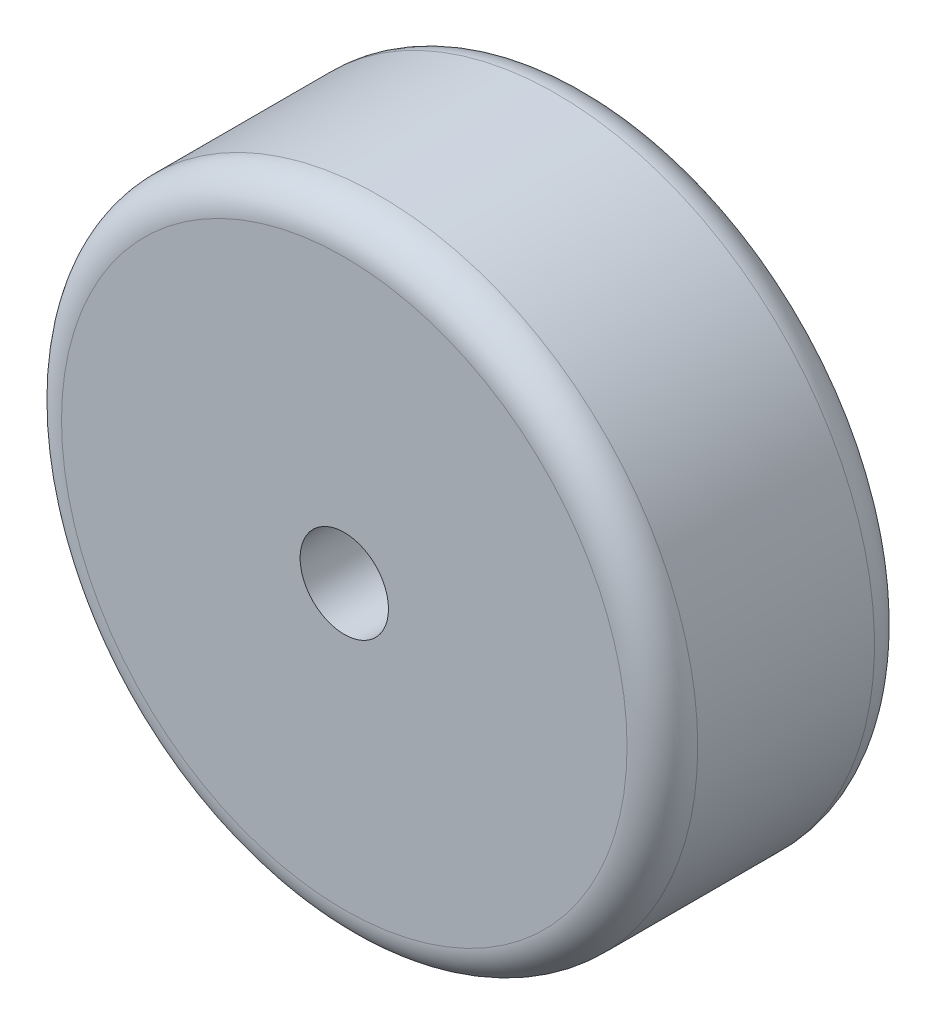
ISO-10303-21;
HEADER;
FILE_DESCRIPTION(('STEP AP214'),'2;1');
FILE_NAME('part.step','',(''),(''),'','','');
FILE_SCHEMA(('AUTOMOTIVE_DESIGN { 1 0 10303 214 1 1 1 1 }'));
ENDSEC;
DATA;
#1=APPLICATION_CONTEXT('core data for automotive mechanical design processes');
#2=APPLICATION_PROTOCOL_DEFINITION('international standard','automotive_design',2000,#1);
#3=PRODUCT_CONTEXT('',#1,'mechanical');
#4=PRODUCT('Part','Part','',(#3));
#5=PRODUCT_RELATED_PRODUCT_CATEGORY('part','',(#4));
#6=PRODUCT_DEFINITION_FORMATION('','',#4);
#7=PRODUCT_DEFINITION_CONTEXT('part definition',#1,'design');
#8=PRODUCT_DEFINITION('design','',#6,#7);
#9=PRODUCT_DEFINITION_SHAPE('','',#8);
#10=(LENGTH_UNIT() NAMED_UNIT(*) SI_UNIT(.MILLI.,.METRE.));
#11=(NAMED_UNIT(*) PLANE_ANGLE_UNIT() SI_UNIT($,.RADIAN.));
#12=(NAMED_UNIT(*) SI_UNIT($,.STERADIAN.) SOLID_ANGLE_UNIT());
#13=UNCERTAINTY_MEASURE_WITH_UNIT(LENGTH_MEASURE(1.E-05),#10,'distance_accuracy_value','');
#14=(GEOMETRIC_REPRESENTATION_CONTEXT(3) GLOBAL_UNCERTAINTY_ASSIGNED_CONTEXT((#13)) GLOBAL_UNIT_ASSIGNED_CONTEXT((#10,
#11,#12)) REPRESENTATION_CONTEXT('',''));
#15=CARTESIAN_POINT('',(0.,0.,0.));
#16=DIRECTION('',(0.,0.,1.));
#17=DIRECTION('',(1.,0.,0.));
#18=AXIS2_PLACEMENT_3D('',#15,#16,#17);
#19=CARTESIAN_POINT('',(0.,0.,7.));
#20=DIRECTION('',(0.,0.,-1.));
#21=DIRECTION('',(-1.,0.,0.));
#22=AXIS2_PLACEMENT_3D('',#19,#20,#21);
#23=CYLINDRICAL_SURFACE('',#22,18.);
#24=CARTESIAN_POINT('',(0.,0.,5.));
#25=DIRECTION('',(0.,0.,1.));
#26=DIRECTION('',(1.,0.,0.));
#27=AXIS2_PLACEMENT_3D('',#24,#25,#26);
#28=CIRCLE('',#27,18.);
#29=CARTESIAN_POINT('',(18.,0.,5.));
#30=VERTEX_POINT('',#29);
#31=EDGE_CURVE('E38',#30,#30,#28,.F.);
#32=ORIENTED_EDGE('',*,*,#31,.T.);
#33=EDGE_LOOP('',(#32));
#34=FACE_BOUND('',#33,.T.);
#35=CARTESIAN_POINT('',(0.,0.,-5.));
#36=DIRECTION('',(0.,0.,-1.));
#37=DIRECTION('',(-1.,0.,0.));
#38=AXIS2_PLACEMENT_3D('',#35,#36,#37);
#39=CIRCLE('',#38,18.);
#40=CARTESIAN_POINT('',(-18.,0.,-5.));
#41=VERTEX_POINT('',#40);
#42=EDGE_CURVE('E42',#41,#41,#39,.F.);
#43=ORIENTED_EDGE('',*,*,#42,.T.);
#44=EDGE_LOOP('',(#43));
#45=FACE_BOUND('',#44,.T.);
#46=ADVANCED_FACE('F31',(#34,#45),#23,.T.);
#47=CARTESIAN_POINT('',(0.,0.,7.));
#48=DIRECTION('',(0.,0.,1.));
#49=DIRECTION('',(1.,0.,0.));
#50=AXIS2_PLACEMENT_3D('',#47,#48,#49);
#51=PLANE('',#50);
#52=CARTESIAN_POINT('',(0.,0.,7.));
#53=DIRECTION('',(0.,0.,1.));
#54=DIRECTION('',(1.,0.,0.));
#55=AXIS2_PLACEMENT_3D('',#52,#53,#54);
#56=CIRCLE('',#55,2.5);
#57=CARTESIAN_POINT('',(2.5,0.,7.));
#58=VERTEX_POINT('',#57);
#59=EDGE_CURVE('E51',#58,#58,#56,.T.);
#60=ORIENTED_EDGE('',*,*,#59,.F.);
#61=EDGE_LOOP('',(#60));
#62=FACE_BOUND('',#61,.T.);
#63=CARTESIAN_POINT('',(0.,0.,7.));
#64=DIRECTION('',(0.,0.,1.));
#65=DIRECTION('',(1.,0.,0.));
#66=AXIS2_PLACEMENT_3D('',#63,#64,#65);
#67=CIRCLE('',#66,16.);
#68=CARTESIAN_POINT('',(16.,0.,7.));
#69=VERTEX_POINT('',#68);
#70=EDGE_CURVE('E46',#69,#69,#67,.T.);
#71=ORIENTED_EDGE('',*,*,#70,.T.);
#72=EDGE_LOOP('',(#71));
#73=FACE_BOUND('',#72,.T.);
#74=ADVANCED_FACE('F60',(#62,#73),#51,.T.);
#75=CARTESIAN_POINT('',(0.,0.,-7.));
#76=DIRECTION('',(0.,0.,-1.));
#77=DIRECTION('',(1.,0.,0.));
#78=AXIS2_PLACEMENT_3D('',#75,#76,#77);
#79=PLANE('',#78);
#80=CARTESIAN_POINT('',(0.,0.,-7.));
#81=DIRECTION('',(0.,0.,-1.));
#82=DIRECTION('',(-1.,0.,0.));
#83=AXIS2_PLACEMENT_3D('',#80,#81,#82);
#84=CIRCLE('',#83,2.5);
#85=CARTESIAN_POINT('',(-2.5,0.,-7.));
#86=VERTEX_POINT('',#85);
#87=EDGE_CURVE('E52',#86,#86,#84,.F.);
#88=ORIENTED_EDGE('',*,*,#87,.T.);
#89=EDGE_LOOP('',(#88));
#90=FACE_BOUND('',#89,.T.);
#91=CARTESIAN_POINT('',(0.,0.,-7.));
#92=DIRECTION('',(0.,0.,-1.));
#93=DIRECTION('',(-1.,0.,0.));
#94=AXIS2_PLACEMENT_3D('',#91,#92,#93);
#95=CIRCLE('',#94,16.);
#96=CARTESIAN_POINT('',(-16.,0.,-7.));
#97=VERTEX_POINT('',#96);
#98=EDGE_CURVE('E10',#97,#97,#95,.T.);
#99=ORIENTED_EDGE('',*,*,#98,.T.);
#100=EDGE_LOOP('',(#99));
#101=FACE_BOUND('',#100,.T.);
#102=ADVANCED_FACE('F63',(#90,#101),#79,.T.);
#103=CARTESIAN_POINT('',(0.,0.,5.));
#104=DIRECTION('',(0.,0.,1.));
#105=DIRECTION('',(1.,0.,0.));
#106=AXIS2_PLACEMENT_3D('',#103,#104,#105);
#107=TOROIDAL_SURFACE('',#106,16.,2.);
#108=ORIENTED_EDGE('',*,*,#31,.F.);
#109=EDGE_LOOP('',(#108));
#110=FACE_BOUND('',#109,.T.);
#111=ORIENTED_EDGE('',*,*,#70,.F.);
#112=EDGE_LOOP('',(#111));
#113=FACE_BOUND('',#112,.T.);
#114=ADVANCED_FACE('F67',(#110,#113),#107,.T.);
#115=CARTESIAN_POINT('',(0.,0.,-5.));
#116=DIRECTION('',(0.,0.,-1.));
#117=DIRECTION('',(-1.,0.,0.));
#118=AXIS2_PLACEMENT_3D('',#115,#116,#117);
#119=TOROIDAL_SURFACE('',#118,16.,2.);
#120=ORIENTED_EDGE('',*,*,#98,.F.);
#121=EDGE_LOOP('',(#120));
#122=FACE_BOUND('',#121,.T.);
#123=ORIENTED_EDGE('',*,*,#42,.F.);
#124=EDGE_LOOP('',(#123));
#125=FACE_BOUND('',#124,.T.);
#126=ADVANCED_FACE('F33',(#122,#125),#119,.T.);
#127=CARTESIAN_POINT('',(0.,0.,-7.001));
#128=DIRECTION('',(0.,0.,1.));
#129=DIRECTION('',(1.,0.,0.));
#130=AXIS2_PLACEMENT_3D('',#127,#128,#129);
#131=CYLINDRICAL_SURFACE('',#130,2.5);
#132=ORIENTED_EDGE('',*,*,#87,.F.);
#133=EDGE_LOOP('',(#132));
#134=FACE_BOUND('',#133,.T.);
#135=ORIENTED_EDGE('',*,*,#59,.T.);
#136=EDGE_LOOP('',(#135));
#137=FACE_BOUND('',#136,.T.);
#138=ADVANCED_FACE('F58',(#134,#137),#131,.F.);
#139=CLOSED_SHELL('',(#46,#74,#102,#114,#126,#138));
#140=MANIFOLD_SOLID_BREP('B2',#139);
#141=ADVANCED_BREP_SHAPE_REPRESENTATION('',(#18,#140),#14);
#142=SHAPE_DEFINITION_REPRESENTATION(#9,#141);
ENDSEC;
END-ISO-10303-21;
